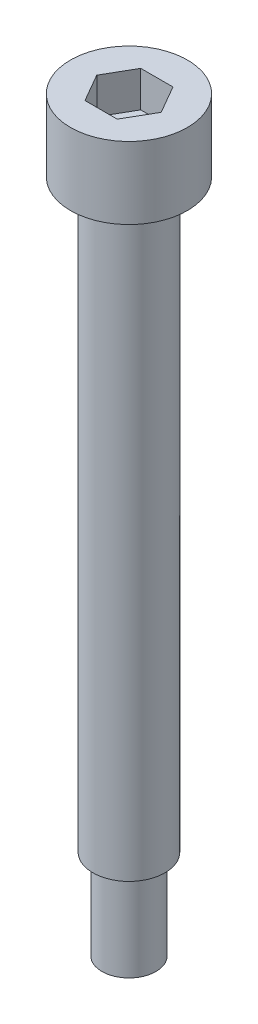
ISO-10303-21;
HEADER;
FILE_DESCRIPTION(('STEP AP214'),'2;1');
FILE_NAME('part.step','',(''),(''),'','','');
FILE_SCHEMA(('AUTOMOTIVE_DESIGN { 1 0 10303 214 1 1 1 1 }'));
ENDSEC;
DATA;
#1=APPLICATION_CONTEXT('core data for automotive mechanical design processes');
#2=APPLICATION_PROTOCOL_DEFINITION('international standard','automotive_design',2000,#1);
#3=PRODUCT_CONTEXT('',#1,'mechanical');
#4=PRODUCT('Part','Part','',(#3));
#5=PRODUCT_RELATED_PRODUCT_CATEGORY('part','',(#4));
#6=PRODUCT_DEFINITION_FORMATION('','',#4);
#7=PRODUCT_DEFINITION_CONTEXT('part definition',#1,'design');
#8=PRODUCT_DEFINITION('design','',#6,#7);
#9=PRODUCT_DEFINITION_SHAPE('','',#8);
#10=(LENGTH_UNIT() NAMED_UNIT(*) SI_UNIT(.MILLI.,.METRE.));
#11=(NAMED_UNIT(*) PLANE_ANGLE_UNIT() SI_UNIT($,.RADIAN.));
#12=(NAMED_UNIT(*) SI_UNIT($,.STERADIAN.) SOLID_ANGLE_UNIT());
#13=UNCERTAINTY_MEASURE_WITH_UNIT(LENGTH_MEASURE(1.E-05),#10,'distance_accuracy_value','');
#14=(GEOMETRIC_REPRESENTATION_CONTEXT(3) GLOBAL_UNCERTAINTY_ASSIGNED_CONTEXT((#13)) GLOBAL_UNIT_ASSIGNED_CONTEXT((#10,
#11,#12)) REPRESENTATION_CONTEXT('',''));
#15=CARTESIAN_POINT('',(0.,0.,0.));
#16=DIRECTION('',(0.,0.,1.));
#17=DIRECTION('',(1.,0.,0.));
#18=AXIS2_PLACEMENT_3D('',#15,#16,#17);
#19=CARTESIAN_POINT('',(0.,8.,0.));
#20=DIRECTION('',(0.,-1.,0.));
#21=DIRECTION('',(0.,0.,-1.));
#22=AXIS2_PLACEMENT_3D('',#19,#20,#21);
#23=CYLINDRICAL_SURFACE('',#22,6.5);
#24=CARTESIAN_POINT('',(0.,8.,0.));
#25=DIRECTION('',(0.,1.,0.));
#26=DIRECTION('',(0.,0.,1.));
#27=AXIS2_PLACEMENT_3D('',#24,#25,#26);
#28=CIRCLE('',#27,6.5);
#29=CARTESIAN_POINT('',(0.,8.,6.5));
#30=VERTEX_POINT('',#29);
#31=EDGE_CURVE('E145',#30,#30,#28,.T.);
#32=ORIENTED_EDGE('',*,*,#31,.F.);
#33=EDGE_LOOP('',(#32));
#34=FACE_BOUND('',#33,.T.);
#35=CARTESIAN_POINT('',(0.,0.,0.));
#36=DIRECTION('',(0.,1.,0.));
#37=DIRECTION('',(0.,0.,1.));
#38=AXIS2_PLACEMENT_3D('',#35,#36,#37);
#39=CIRCLE('',#38,6.5);
#40=CARTESIAN_POINT('',(0.,0.,6.5));
#41=VERTEX_POINT('',#40);
#42=EDGE_CURVE('E40',#41,#41,#39,.T.);
#43=ORIENTED_EDGE('',*,*,#42,.T.);
#44=EDGE_LOOP('',(#43));
#45=FACE_BOUND('',#44,.T.);
#46=ADVANCED_FACE('F37',(#34,#45),#23,.T.);
#47=CARTESIAN_POINT('',(0.,8.,0.));
#48=DIRECTION('',(0.,1.,0.));
#49=DIRECTION('',(0.,0.,1.));
#50=AXIS2_PLACEMENT_3D('',#47,#48,#49);
#51=PLANE('',#50);
#52=DIRECTION('',(0.5,0.,-0.866025403784439));
#53=VECTOR('',#52,1.);
#54=CARTESIAN_POINT('',(1.78978583448784,8.,3.1));
#55=LINE('',#54,#53);
#56=CARTESIAN_POINT('',(1.78978583448784,8.,3.1));
#57=VERTEX_POINT('',#56);
#58=CARTESIAN_POINT('',(3.57957166897568,8.,0.));
#59=VERTEX_POINT('',#58);
#60=EDGE_CURVE('E53',#57,#59,#55,.T.);
#61=ORIENTED_EDGE('',*,*,#60,.F.);
#62=DIRECTION('',(1.,0.,0.));
#63=VECTOR('',#62,1.);
#64=CARTESIAN_POINT('',(-1.78978583448784,8.,3.1));
#65=LINE('',#64,#63);
#66=CARTESIAN_POINT('',(-1.78978583448784,8.,3.1));
#67=VERTEX_POINT('',#66);
#68=EDGE_CURVE('E137',#67,#57,#65,.T.);
#69=ORIENTED_EDGE('',*,*,#68,.F.);
#70=DIRECTION('',(0.5,0.,0.866025403784439));
#71=VECTOR('',#70,1.);
#72=CARTESIAN_POINT('',(-3.57957166897568,8.,0.));
#73=LINE('',#72,#71);
#74=CARTESIAN_POINT('',(-3.57957166897568,8.,0.));
#75=VERTEX_POINT('',#74);
#76=EDGE_CURVE('E135',#75,#67,#73,.T.);
#77=ORIENTED_EDGE('',*,*,#76,.F.);
#78=DIRECTION('',(-0.5,0.,0.866025403784439));
#79=VECTOR('',#78,1.);
#80=CARTESIAN_POINT('',(-1.78978583448784,8.,-3.1));
#81=LINE('',#80,#79);
#82=CARTESIAN_POINT('',(-1.78978583448784,8.,-3.1));
#83=VERTEX_POINT('',#82);
#84=EDGE_CURVE('E101',#83,#75,#81,.T.);
#85=ORIENTED_EDGE('',*,*,#84,.F.);
#86=DIRECTION('',(-1.,0.,0.));
#87=VECTOR('',#86,1.);
#88=CARTESIAN_POINT('',(1.78978583448784,8.,-3.1));
#89=LINE('',#88,#87);
#90=CARTESIAN_POINT('',(1.78978583448784,8.,-3.1));
#91=VERTEX_POINT('',#90);
#92=EDGE_CURVE('E131',#91,#83,#89,.T.);
#93=ORIENTED_EDGE('',*,*,#92,.F.);
#94=DIRECTION('',(-0.5,0.,-0.866025403784439));
#95=VECTOR('',#94,1.);
#96=CARTESIAN_POINT('',(3.57957166897568,8.,0.));
#97=LINE('',#96,#95);
#98=EDGE_CURVE('E127',#59,#91,#97,.T.);
#99=ORIENTED_EDGE('',*,*,#98,.F.);
#100=EDGE_LOOP('',(#61,#69,#77,#85,#93,#99));
#101=FACE_BOUND('',#100,.T.);
#102=ORIENTED_EDGE('',*,*,#31,.T.);
#103=EDGE_LOOP('',(#102));
#104=FACE_BOUND('',#103,.T.);
#105=ADVANCED_FACE('F158',(#101,#104),#51,.T.);
#106=CARTESIAN_POINT('',(0.,0.,0.));
#107=DIRECTION('',(0.,1.,0.));
#108=DIRECTION('',(0.,0.,1.));
#109=AXIS2_PLACEMENT_3D('',#106,#107,#108);
#110=PLANE('',#109);
#111=CARTESIAN_POINT('',(0.,0.,0.));
#112=DIRECTION('',(0.,-1.,0.));
#113=DIRECTION('',(0.,0.,-1.));
#114=AXIS2_PLACEMENT_3D('',#111,#112,#113);
#115=CIRCLE('',#114,4.);
#116=CARTESIAN_POINT('',(0.,0.,-4.));
#117=VERTEX_POINT('',#116);
#118=EDGE_CURVE('E45',#117,#117,#115,.T.);
#119=ORIENTED_EDGE('',*,*,#118,.F.);
#120=EDGE_LOOP('',(#119));
#121=FACE_BOUND('',#120,.T.);
#122=ORIENTED_EDGE('',*,*,#42,.F.);
#123=EDGE_LOOP('',(#122));
#124=FACE_BOUND('',#123,.T.);
#125=ADVANCED_FACE('F155',(#121,#124),#110,.F.);
#126=CARTESIAN_POINT('',(1.78978583448784,4.,3.1));
#127=DIRECTION('',(0.866025403784439,0.,0.5));
#128=DIRECTION('',(0.5,0.,-0.866025403784439));
#129=AXIS2_PLACEMENT_3D('',#126,#127,#128);
#130=PLANE('',#129);
#131=ORIENTED_EDGE('',*,*,#60,.T.);
#132=DIRECTION('',(0.,1.,0.));
#133=VECTOR('',#132,1.);
#134=CARTESIAN_POINT('',(3.57957166897568,4.,0.));
#135=LINE('',#134,#133);
#136=CARTESIAN_POINT('',(3.57957166897568,4.,0.));
#137=VERTEX_POINT('',#136);
#138=EDGE_CURVE('E83',#137,#59,#135,.T.);
#139=ORIENTED_EDGE('',*,*,#138,.F.);
#140=DIRECTION('',(0.5,0.,-0.866025403784439));
#141=VECTOR('',#140,1.);
#142=CARTESIAN_POINT('',(1.78978583448784,4.,3.1));
#143=LINE('',#142,#141);
#144=CARTESIAN_POINT('',(1.78978583448784,4.,3.1));
#145=VERTEX_POINT('',#144);
#146=EDGE_CURVE('E139',#145,#137,#143,.T.);
#147=ORIENTED_EDGE('',*,*,#146,.F.);
#148=DIRECTION('',(0.,1.,0.));
#149=VECTOR('',#148,1.);
#150=CARTESIAN_POINT('',(1.78978583448784,4.,3.1));
#151=LINE('',#150,#149);
#152=EDGE_CURVE('E61',#145,#57,#151,.T.);
#153=ORIENTED_EDGE('',*,*,#152,.T.);
#154=EDGE_LOOP('',(#131,#139,#147,#153));
#155=FACE_BOUND('',#154,.T.);
#156=ADVANCED_FACE('F157',(#155),#130,.F.);
#157=CARTESIAN_POINT('',(-1.78978583448784,4.,3.1));
#158=DIRECTION('',(0.,0.,1.));
#159=DIRECTION('',(1.,0.,0.));
#160=AXIS2_PLACEMENT_3D('',#157,#158,#159);
#161=PLANE('',#160);
#162=ORIENTED_EDGE('',*,*,#68,.T.);
#163=ORIENTED_EDGE('',*,*,#152,.F.);
#164=DIRECTION('',(1.,0.,0.));
#165=VECTOR('',#164,1.);
#166=CARTESIAN_POINT('',(-1.78978583448784,4.,3.1));
#167=LINE('',#166,#165);
#168=CARTESIAN_POINT('',(-1.78978583448784,4.,3.1));
#169=VERTEX_POINT('',#168);
#170=EDGE_CURVE('E113',#169,#145,#167,.T.);
#171=ORIENTED_EDGE('',*,*,#170,.F.);
#172=DIRECTION('',(0.,1.,0.));
#173=VECTOR('',#172,1.);
#174=CARTESIAN_POINT('',(-1.78978583448784,4.,3.1));
#175=LINE('',#174,#173);
#176=EDGE_CURVE('E105',#169,#67,#175,.T.);
#177=ORIENTED_EDGE('',*,*,#176,.T.);
#178=EDGE_LOOP('',(#162,#163,#171,#177));
#179=FACE_BOUND('',#178,.T.);
#180=ADVANCED_FACE('F164',(#179),#161,.F.);
#181=CARTESIAN_POINT('',(-3.57957166897568,4.,0.));
#182=DIRECTION('',(-0.866025403784439,0.,0.5));
#183=DIRECTION('',(0.5,0.,0.866025403784439));
#184=AXIS2_PLACEMENT_3D('',#181,#182,#183);
#185=PLANE('',#184);
#186=ORIENTED_EDGE('',*,*,#76,.T.);
#187=ORIENTED_EDGE('',*,*,#176,.F.);
#188=DIRECTION('',(0.5,0.,0.866025403784439));
#189=VECTOR('',#188,1.);
#190=CARTESIAN_POINT('',(-3.57957166897568,4.,0.));
#191=LINE('',#190,#189);
#192=CARTESIAN_POINT('',(-3.57957166897568,4.,0.));
#193=VERTEX_POINT('',#192);
#194=EDGE_CURVE('E109',#193,#169,#191,.T.);
#195=ORIENTED_EDGE('',*,*,#194,.F.);
#196=DIRECTION('',(0.,1.,0.));
#197=VECTOR('',#196,1.);
#198=CARTESIAN_POINT('',(-3.57957166897568,4.,0.));
#199=LINE('',#198,#197);
#200=EDGE_CURVE('E94',#193,#75,#199,.T.);
#201=ORIENTED_EDGE('',*,*,#200,.T.);
#202=EDGE_LOOP('',(#186,#187,#195,#201));
#203=FACE_BOUND('',#202,.T.);
#204=ADVANCED_FACE('F110',(#203),#185,.F.);
#205=CARTESIAN_POINT('',(-1.78978583448784,4.,-3.1));
#206=DIRECTION('',(-0.866025403784439,0.,-0.5));
#207=DIRECTION('',(-0.5,0.,0.866025403784439));
#208=AXIS2_PLACEMENT_3D('',#205,#206,#207);
#209=PLANE('',#208);
#210=ORIENTED_EDGE('',*,*,#84,.T.);
#211=ORIENTED_EDGE('',*,*,#200,.F.);
#212=DIRECTION('',(-0.5,0.,0.866025403784439));
#213=VECTOR('',#212,1.);
#214=CARTESIAN_POINT('',(-1.78978583448784,4.,-3.1));
#215=LINE('',#214,#213);
#216=CARTESIAN_POINT('',(-1.78978583448784,4.,-3.1));
#217=VERTEX_POINT('',#216);
#218=EDGE_CURVE('E98',#217,#193,#215,.T.);
#219=ORIENTED_EDGE('',*,*,#218,.F.);
#220=DIRECTION('',(0.,1.,0.));
#221=VECTOR('',#220,1.);
#222=CARTESIAN_POINT('',(-1.78978583448784,4.,-3.1));
#223=LINE('',#222,#221);
#224=EDGE_CURVE('E106',#217,#83,#223,.T.);
#225=ORIENTED_EDGE('',*,*,#224,.T.);
#226=EDGE_LOOP('',(#210,#211,#219,#225));
#227=FACE_BOUND('',#226,.T.);
#228=ADVANCED_FACE('F96',(#227),#209,.F.);
#229=CARTESIAN_POINT('',(1.78978583448784,4.,-3.1));
#230=DIRECTION('',(0.,0.,-1.));
#231=DIRECTION('',(-1.,0.,0.));
#232=AXIS2_PLACEMENT_3D('',#229,#230,#231);
#233=PLANE('',#232);
#234=ORIENTED_EDGE('',*,*,#92,.T.);
#235=ORIENTED_EDGE('',*,*,#224,.F.);
#236=DIRECTION('',(-1.,0.,0.));
#237=VECTOR('',#236,1.);
#238=CARTESIAN_POINT('',(1.78978583448784,4.,-3.1));
#239=LINE('',#238,#237);
#240=CARTESIAN_POINT('',(1.78978583448784,4.,-3.1));
#241=VERTEX_POINT('',#240);
#242=EDGE_CURVE('E119',#241,#217,#239,.T.);
#243=ORIENTED_EDGE('',*,*,#242,.F.);
#244=DIRECTION('',(0.,1.,0.));
#245=VECTOR('',#244,1.);
#246=CARTESIAN_POINT('',(1.78978583448784,4.,-3.1));
#247=LINE('',#246,#245);
#248=EDGE_CURVE('E143',#241,#91,#247,.T.);
#249=ORIENTED_EDGE('',*,*,#248,.T.);
#250=EDGE_LOOP('',(#234,#235,#243,#249));
#251=FACE_BOUND('',#250,.T.);
#252=ADVANCED_FACE('F209',(#251),#233,.F.);
#253=CARTESIAN_POINT('',(3.57957166897568,4.,0.));
#254=DIRECTION('',(0.866025403784439,0.,-0.5));
#255=DIRECTION('',(-0.5,0.,-0.866025403784439));
#256=AXIS2_PLACEMENT_3D('',#253,#254,#255);
#257=PLANE('',#256);
#258=ORIENTED_EDGE('',*,*,#98,.T.);
#259=ORIENTED_EDGE('',*,*,#248,.F.);
#260=DIRECTION('',(-0.5,0.,-0.866025403784439));
#261=VECTOR('',#260,1.);
#262=CARTESIAN_POINT('',(3.57957166897568,4.,0.));
#263=LINE('',#262,#261);
#264=EDGE_CURVE('E121',#137,#241,#263,.T.);
#265=ORIENTED_EDGE('',*,*,#264,.F.);
#266=ORIENTED_EDGE('',*,*,#138,.T.);
#267=EDGE_LOOP('',(#258,#259,#265,#266));
#268=FACE_BOUND('',#267,.T.);
#269=ADVANCED_FACE('F218',(#268),#257,.F.);
#270=CARTESIAN_POINT('',(0.,4.,0.));
#271=DIRECTION('',(0.,1.,0.));
#272=DIRECTION('',(0.,0.,1.));
#273=AXIS2_PLACEMENT_3D('',#270,#271,#272);
#274=PLANE('',#273);
#275=ORIENTED_EDGE('',*,*,#146,.T.);
#276=ORIENTED_EDGE('',*,*,#264,.T.);
#277=ORIENTED_EDGE('',*,*,#242,.T.);
#278=ORIENTED_EDGE('',*,*,#218,.T.);
#279=ORIENTED_EDGE('',*,*,#194,.T.);
#280=ORIENTED_EDGE('',*,*,#170,.T.);
#281=EDGE_LOOP('',(#275,#276,#277,#278,#279,#280));
#282=FACE_BOUND('',#281,.T.);
#283=ADVANCED_FACE('F116',(#282),#274,.T.);
#284=CARTESIAN_POINT('',(0.,-65.,0.));
#285=DIRECTION('',(0.,1.,0.));
#286=DIRECTION('',(0.,0.,1.));
#287=AXIS2_PLACEMENT_3D('',#284,#285,#286);
#288=CYLINDRICAL_SURFACE('',#287,4.);
#289=CARTESIAN_POINT('',(0.,-65.,0.));
#290=DIRECTION('',(0.,-1.,0.));
#291=DIRECTION('',(0.,0.,-1.));
#292=AXIS2_PLACEMENT_3D('',#289,#290,#291);
#293=CIRCLE('',#292,4.);
#294=CARTESIAN_POINT('',(0.,-65.,-4.));
#295=VERTEX_POINT('',#294);
#296=EDGE_CURVE('E128',#295,#295,#293,.T.);
#297=ORIENTED_EDGE('',*,*,#296,.F.);
#298=EDGE_LOOP('',(#297));
#299=FACE_BOUND('',#298,.T.);
#300=ORIENTED_EDGE('',*,*,#118,.T.);
#301=EDGE_LOOP('',(#300));
#302=FACE_BOUND('',#301,.T.);
#303=ADVANCED_FACE('F236',(#299,#302),#288,.T.);
#304=CARTESIAN_POINT('',(0.,-65.,0.));
#305=DIRECTION('',(0.,-1.,0.));
#306=DIRECTION('',(0.,0.,-1.));
#307=AXIS2_PLACEMENT_3D('',#304,#305,#306);
#308=PLANE('',#307);
#309=CARTESIAN_POINT('',(0.,-65.,0.));
#310=DIRECTION('',(0.,-1.,0.));
#311=DIRECTION('',(0.,0.,-1.));
#312=AXIS2_PLACEMENT_3D('',#309,#310,#311);
#313=CIRCLE('',#312,3.);
#314=CARTESIAN_POINT('',(0.,-65.,-3.));
#315=VERTEX_POINT('',#314);
#316=EDGE_CURVE('E11',#315,#315,#313,.T.);
#317=ORIENTED_EDGE('',*,*,#316,.F.);
#318=EDGE_LOOP('',(#317));
#319=FACE_BOUND('',#318,.T.);
#320=ORIENTED_EDGE('',*,*,#296,.T.);
#321=EDGE_LOOP('',(#320));
#322=FACE_BOUND('',#321,.T.);
#323=ADVANCED_FACE('F250',(#319,#322),#308,.T.);
#324=CARTESIAN_POINT('',(0.,-75.,0.));
#325=DIRECTION('',(0.,1.,0.));
#326=DIRECTION('',(0.,0.,1.));
#327=AXIS2_PLACEMENT_3D('',#324,#325,#326);
#328=CYLINDRICAL_SURFACE('',#327,3.);
#329=CARTESIAN_POINT('',(0.,-75.,0.));
#330=DIRECTION('',(0.,-1.,0.));
#331=DIRECTION('',(0.,0.,-1.));
#332=AXIS2_PLACEMENT_3D('',#329,#330,#331);
#333=CIRCLE('',#332,3.);
#334=CARTESIAN_POINT('',(0.,-75.,-3.));
#335=VERTEX_POINT('',#334);
#336=EDGE_CURVE('E284',#335,#335,#333,.T.);
#337=ORIENTED_EDGE('',*,*,#336,.F.);
#338=EDGE_LOOP('',(#337));
#339=FACE_BOUND('',#338,.T.);
#340=ORIENTED_EDGE('',*,*,#316,.T.);
#341=EDGE_LOOP('',(#340));
#342=FACE_BOUND('',#341,.T.);
#343=ADVANCED_FACE('F260',(#339,#342),#328,.T.);
#344=CARTESIAN_POINT('',(0.,-75.,0.));
#345=DIRECTION('',(0.,-1.,0.));
#346=DIRECTION('',(0.,0.,-1.));
#347=AXIS2_PLACEMENT_3D('',#344,#345,#346);
#348=PLANE('',#347);
#349=ORIENTED_EDGE('',*,*,#336,.T.);
#350=EDGE_LOOP('',(#349));
#351=FACE_BOUND('',#350,.T.);
#352=ADVANCED_FACE('F268',(#351),#348,.T.);
#353=CLOSED_SHELL('',(#46,#105,#125,#156,#180,#204,#228,#252,#269,#283,#303,#323,#343,#352));
#354=MANIFOLD_SOLID_BREP('B2',#353);
#355=ADVANCED_BREP_SHAPE_REPRESENTATION('',(#18,#354),#14);
#356=SHAPE_DEFINITION_REPRESENTATION(#9,#355);
ENDSEC;
END-ISO-10303-21;
